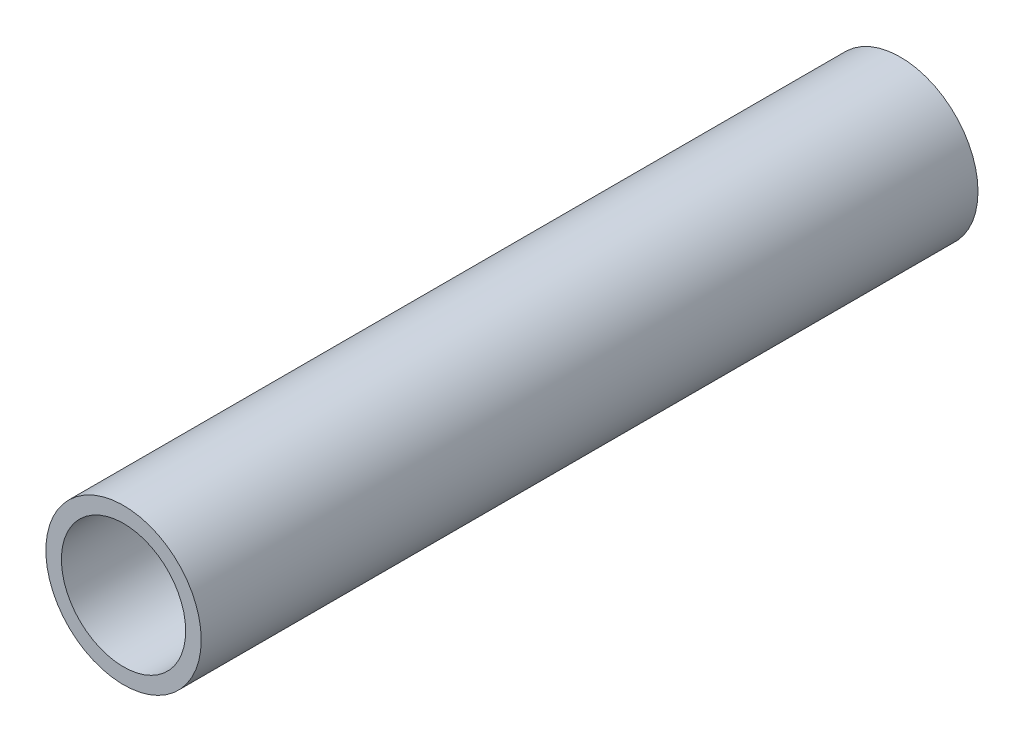
ISO-10303-21;
HEADER;
FILE_DESCRIPTION(('STEP AP214'),'2;1');
FILE_NAME('part.step','',(''),(''),'','','');
FILE_SCHEMA(('AUTOMOTIVE_DESIGN { 1 0 10303 214 1 1 1 1 }'));
ENDSEC;
DATA;
#1=APPLICATION_CONTEXT('core data for automotive mechanical design processes');
#2=APPLICATION_PROTOCOL_DEFINITION('international standard','automotive_design',2000,#1);
#3=PRODUCT_CONTEXT('',#1,'mechanical');
#4=PRODUCT('Part','Part','',(#3));
#5=PRODUCT_RELATED_PRODUCT_CATEGORY('part','',(#4));
#6=PRODUCT_DEFINITION_FORMATION('','',#4);
#7=PRODUCT_DEFINITION_CONTEXT('part definition',#1,'design');
#8=PRODUCT_DEFINITION('design','',#6,#7);
#9=PRODUCT_DEFINITION_SHAPE('','',#8);
#10=(LENGTH_UNIT() NAMED_UNIT(*) SI_UNIT(.MILLI.,.METRE.));
#11=(NAMED_UNIT(*) PLANE_ANGLE_UNIT() SI_UNIT($,.RADIAN.));
#12=(NAMED_UNIT(*) SI_UNIT($,.STERADIAN.) SOLID_ANGLE_UNIT());
#13=UNCERTAINTY_MEASURE_WITH_UNIT(LENGTH_MEASURE(1.E-05),#10,'distance_accuracy_value','');
#14=(GEOMETRIC_REPRESENTATION_CONTEXT(3) GLOBAL_UNCERTAINTY_ASSIGNED_CONTEXT((#13)) GLOBAL_UNIT_ASSIGNED_CONTEXT((#10,
#11,#12)) REPRESENTATION_CONTEXT('',''));
#15=CARTESIAN_POINT('',(0.,0.,0.));
#16=DIRECTION('',(0.,0.,1.));
#17=DIRECTION('',(1.,0.,0.));
#18=AXIS2_PLACEMENT_3D('',#15,#16,#17);
#19=CARTESIAN_POINT('',(0.,0.,127.));
#20=DIRECTION('',(0.,0.,1.));
#21=DIRECTION('',(1.,0.,0.));
#22=AXIS2_PLACEMENT_3D('',#19,#20,#21);
#23=PLANE('',#22);
#24=CARTESIAN_POINT('',(0.,0.,127.));
#25=DIRECTION('',(0.,0.,1.));
#26=DIRECTION('',(1.,0.,0.));
#27=AXIS2_PLACEMENT_3D('',#24,#25,#26);
#28=CIRCLE('',#27,12.7);
#29=CARTESIAN_POINT('',(12.7,0.,127.));
#30=VERTEX_POINT('',#29);
#31=EDGE_CURVE('E10',#30,#30,#28,.T.);
#32=ORIENTED_EDGE('',*,*,#31,.T.);
#33=EDGE_LOOP('',(#32));
#34=FACE_BOUND('',#33,.T.);
#35=CARTESIAN_POINT('',(0.,0.,127.));
#36=DIRECTION('',(0.,0.,1.));
#37=DIRECTION('',(1.,0.,0.));
#38=AXIS2_PLACEMENT_3D('',#35,#36,#37);
#39=CIRCLE('',#38,10.16);
#40=CARTESIAN_POINT('',(10.16,0.,127.));
#41=VERTEX_POINT('',#40);
#42=EDGE_CURVE('E41',#41,#41,#39,.T.);
#43=ORIENTED_EDGE('',*,*,#42,.F.);
#44=EDGE_LOOP('',(#43));
#45=FACE_BOUND('',#44,.T.);
#46=ADVANCED_FACE('F30',(#34,#45),#23,.T.);
#47=CARTESIAN_POINT('',(0.,0.,0.));
#48=DIRECTION('',(0.,0.,1.));
#49=DIRECTION('',(1.,0.,0.));
#50=AXIS2_PLACEMENT_3D('',#47,#48,#49);
#51=PLANE('',#50);
#52=CARTESIAN_POINT('',(0.,0.,0.));
#53=DIRECTION('',(0.,0.,1.));
#54=DIRECTION('',(1.,0.,0.));
#55=AXIS2_PLACEMENT_3D('',#52,#53,#54);
#56=CIRCLE('',#55,12.7);
#57=CARTESIAN_POINT('',(12.7,0.,0.));
#58=VERTEX_POINT('',#57);
#59=EDGE_CURVE('E34',#58,#58,#56,.T.);
#60=ORIENTED_EDGE('',*,*,#59,.F.);
#61=EDGE_LOOP('',(#60));
#62=FACE_BOUND('',#61,.T.);
#63=CARTESIAN_POINT('',(0.,0.,0.));
#64=DIRECTION('',(0.,0.,1.));
#65=DIRECTION('',(1.,0.,0.));
#66=AXIS2_PLACEMENT_3D('',#63,#64,#65);
#67=CIRCLE('',#66,10.16);
#68=CARTESIAN_POINT('',(10.16,0.,0.));
#69=VERTEX_POINT('',#68);
#70=EDGE_CURVE('E43',#69,#69,#67,.T.);
#71=ORIENTED_EDGE('',*,*,#70,.T.);
#72=EDGE_LOOP('',(#71));
#73=FACE_BOUND('',#72,.T.);
#74=ADVANCED_FACE('F53',(#62,#73),#51,.F.);
#75=CARTESIAN_POINT('',(0.,0.,127.));
#76=DIRECTION('',(0.,0.,-1.));
#77=DIRECTION('',(-1.,0.,0.));
#78=AXIS2_PLACEMENT_3D('',#75,#76,#77);
#79=CYLINDRICAL_SURFACE('',#78,12.7);
#80=ORIENTED_EDGE('',*,*,#31,.F.);
#81=EDGE_LOOP('',(#80));
#82=FACE_BOUND('',#81,.T.);
#83=ORIENTED_EDGE('',*,*,#59,.T.);
#84=EDGE_LOOP('',(#83));
#85=FACE_BOUND('',#84,.T.);
#86=ADVANCED_FACE('F32',(#82,#85),#79,.T.);
#87=CARTESIAN_POINT('',(0.,0.,127.));
#88=DIRECTION('',(0.,0.,-1.));
#89=DIRECTION('',(-1.,0.,0.));
#90=AXIS2_PLACEMENT_3D('',#87,#88,#89);
#91=CYLINDRICAL_SURFACE('',#90,10.16);
#92=ORIENTED_EDGE('',*,*,#42,.T.);
#93=EDGE_LOOP('',(#92));
#94=FACE_BOUND('',#93,.T.);
#95=ORIENTED_EDGE('',*,*,#70,.F.);
#96=EDGE_LOOP('',(#95));
#97=FACE_BOUND('',#96,.T.);
#98=ADVANCED_FACE('F49',(#94,#97),#91,.F.);
#99=CLOSED_SHELL('',(#46,#74,#86,#98));
#100=MANIFOLD_SOLID_BREP('B2',#99);
#101=ADVANCED_BREP_SHAPE_REPRESENTATION('',(#18,#100),#14);
#102=SHAPE_DEFINITION_REPRESENTATION(#9,#101);
ENDSEC;
END-ISO-10303-21;
